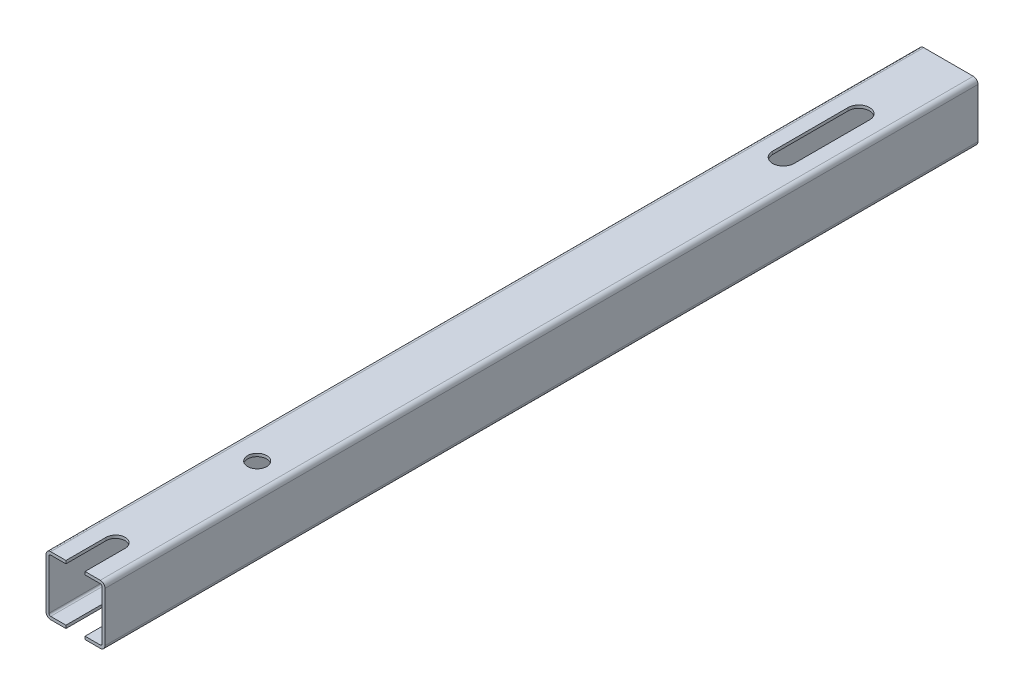
ISO-10303-21;
HEADER;
FILE_DESCRIPTION(('STEP AP214'),'2;1');
FILE_NAME('part.step','',(''),(''),'','','');
FILE_SCHEMA(('AUTOMOTIVE_DESIGN { 1 0 10303 214 1 1 1 1 }'));
ENDSEC;
DATA;
#1=APPLICATION_CONTEXT('core data for automotive mechanical design processes');
#2=APPLICATION_PROTOCOL_DEFINITION('international standard','automotive_design',2000,#1);
#3=PRODUCT_CONTEXT('',#1,'mechanical');
#4=PRODUCT('Part','Part','',(#3));
#5=PRODUCT_RELATED_PRODUCT_CATEGORY('part','',(#4));
#6=PRODUCT_DEFINITION_FORMATION('','',#4);
#7=PRODUCT_DEFINITION_CONTEXT('part definition',#1,'design');
#8=PRODUCT_DEFINITION('design','',#6,#7);
#9=PRODUCT_DEFINITION_SHAPE('','',#8);
#10=(LENGTH_UNIT() NAMED_UNIT(*) SI_UNIT(.MILLI.,.METRE.));
#11=(NAMED_UNIT(*) PLANE_ANGLE_UNIT() SI_UNIT($,.RADIAN.));
#12=(NAMED_UNIT(*) SI_UNIT($,.STERADIAN.) SOLID_ANGLE_UNIT());
#13=UNCERTAINTY_MEASURE_WITH_UNIT(LENGTH_MEASURE(1.E-05),#10,'distance_accuracy_value','');
#14=(GEOMETRIC_REPRESENTATION_CONTEXT(3) GLOBAL_UNCERTAINTY_ASSIGNED_CONTEXT((#13)) GLOBAL_UNIT_ASSIGNED_CONTEXT((#10,
#11,#12)) REPRESENTATION_CONTEXT('',''));
#15=CARTESIAN_POINT('',(0.,0.,0.));
#16=DIRECTION('',(0.,0.,1.));
#17=DIRECTION('',(1.,0.,0.));
#18=AXIS2_PLACEMENT_3D('',#15,#16,#17);
#19=CARTESIAN_POINT('',(23.,2.,370.));
#20=DIRECTION('',(0.,0.,1.));
#21=DIRECTION('',(1.,0.,0.));
#22=AXIS2_PLACEMENT_3D('',#19,#20,#21);
#23=PLANE('',#22);
#24=DIRECTION('',(0.,1.,0.));
#25=VECTOR('',#24,1.);
#26=CARTESIAN_POINT('',(16.55,0.,370.));
#27=LINE('',#26,#25);
#28=CARTESIAN_POINT('',(16.55,0.,370.));
#29=VERTEX_POINT('',#28);
#30=CARTESIAN_POINT('',(16.55,1.25,370.));
#31=VERTEX_POINT('',#30);
#32=EDGE_CURVE('E417',#29,#31,#27,.T.);
#33=ORIENTED_EDGE('',*,*,#32,.F.);
#34=DIRECTION('',(1.,0.,0.));
#35=VECTOR('',#34,1.);
#36=CARTESIAN_POINT('',(2.00000000000001,0.,370.));
#37=LINE('',#36,#35);
#38=CARTESIAN_POINT('',(23.,0.,370.));
#39=VERTEX_POINT('',#38);
#40=EDGE_CURVE('E522',#29,#39,#37,.T.);
#41=ORIENTED_EDGE('',*,*,#40,.T.);
#42=CARTESIAN_POINT('',(23.,2.,370.));
#43=DIRECTION('',(0.,0.,1.));
#44=DIRECTION('',(1.,0.,0.));
#45=AXIS2_PLACEMENT_3D('',#42,#43,#44);
#46=CIRCLE('',#45,2.);
#47=CARTESIAN_POINT('',(25.,2.00000000000001,370.));
#48=VERTEX_POINT('',#47);
#49=EDGE_CURVE('E347',#39,#48,#46,.T.);
#50=ORIENTED_EDGE('',*,*,#49,.T.);
#51=DIRECTION('',(0.,1.,0.));
#52=VECTOR('',#51,1.);
#53=CARTESIAN_POINT('',(25.,2.00000000000001,370.));
#54=LINE('',#53,#52);
#55=CARTESIAN_POINT('',(25.,23.,370.));
#56=VERTEX_POINT('',#55);
#57=EDGE_CURVE('E353',#48,#56,#54,.T.);
#58=ORIENTED_EDGE('',*,*,#57,.T.);
#59=CARTESIAN_POINT('',(23.,23.,370.));
#60=DIRECTION('',(0.,0.,1.));
#61=DIRECTION('',(-1.,0.,0.));
#62=AXIS2_PLACEMENT_3D('',#59,#60,#61);
#63=CIRCLE('',#62,2.);
#64=CARTESIAN_POINT('',(23.,25.,370.));
#65=VERTEX_POINT('',#64);
#66=EDGE_CURVE('E506',#56,#65,#63,.T.);
#67=ORIENTED_EDGE('',*,*,#66,.T.);
#68=DIRECTION('',(-1.,0.,0.));
#69=VECTOR('',#68,1.);
#70=CARTESIAN_POINT('',(2.00000000000001,25.,370.));
#71=LINE('',#70,#69);
#72=CARTESIAN_POINT('',(16.55,25.,370.));
#73=VERTEX_POINT('',#72);
#74=EDGE_CURVE('E510',#65,#73,#71,.T.);
#75=ORIENTED_EDGE('',*,*,#74,.T.);
#76=CARTESIAN_POINT('',(16.55,23.75,370.));
#77=VERTEX_POINT('',#76);
#78=EDGE_CURVE('E650',#77,#73,#27,.T.);
#79=ORIENTED_EDGE('',*,*,#78,.F.);
#80=DIRECTION('',(-1.,0.,0.));
#81=VECTOR('',#80,1.);
#82=CARTESIAN_POINT('',(2.00000000000001,23.75,370.));
#83=LINE('',#82,#81);
#84=CARTESIAN_POINT('',(23.,23.75,370.));
#85=VERTEX_POINT('',#84);
#86=EDGE_CURVE('E423',#85,#77,#83,.T.);
#87=ORIENTED_EDGE('',*,*,#86,.F.);
#88=CARTESIAN_POINT('',(23.,23.,370.));
#89=DIRECTION('',(0.,0.,1.));
#90=DIRECTION('',(-1.,0.,0.));
#91=AXIS2_PLACEMENT_3D('',#88,#89,#90);
#92=CIRCLE('',#91,0.750000000000001);
#93=CARTESIAN_POINT('',(23.75,23.,370.));
#94=VERTEX_POINT('',#93);
#95=EDGE_CURVE('E439',#94,#85,#92,.T.);
#96=ORIENTED_EDGE('',*,*,#95,.F.);
#97=DIRECTION('',(0.,1.,0.));
#98=VECTOR('',#97,1.);
#99=CARTESIAN_POINT('',(23.75,2.,370.));
#100=LINE('',#99,#98);
#101=CARTESIAN_POINT('',(23.75,2.,370.));
#102=VERTEX_POINT('',#101);
#103=EDGE_CURVE('E682',#102,#94,#100,.T.);
#104=ORIENTED_EDGE('',*,*,#103,.F.);
#105=CARTESIAN_POINT('',(23.,2.,370.));
#106=DIRECTION('',(0.,0.,1.));
#107=DIRECTION('',(1.,0.,0.));
#108=AXIS2_PLACEMENT_3D('',#105,#106,#107);
#109=CIRCLE('',#108,0.75);
#110=CARTESIAN_POINT('',(23.,1.25,370.));
#111=VERTEX_POINT('',#110);
#112=EDGE_CURVE('E645',#111,#102,#109,.T.);
#113=ORIENTED_EDGE('',*,*,#112,.F.);
#114=DIRECTION('',(1.,0.,0.));
#115=VECTOR('',#114,1.);
#116=CARTESIAN_POINT('',(2.00000000000001,1.25,370.));
#117=LINE('',#116,#115);
#118=EDGE_CURVE('E640',#31,#111,#117,.T.);
#119=ORIENTED_EDGE('',*,*,#118,.F.);
#120=EDGE_LOOP('',(#33,#41,#50,#58,#67,#75,#79,#87,#96,#104,#113,#119));
#121=FACE_BOUND('',#120,.T.);
#122=ADVANCED_FACE('F40',(#121),#23,.T.);
#123=DIRECTION('',(0.,1.,0.));
#124=VECTOR('',#123,1.);
#125=CARTESIAN_POINT('',(8.44999999999999,0.,370.));
#126=LINE('',#125,#124);
#127=CARTESIAN_POINT('',(8.44999999999999,23.75,370.));
#128=VERTEX_POINT('',#127);
#129=CARTESIAN_POINT('',(8.44999999999999,25.,370.));
#130=VERTEX_POINT('',#129);
#131=EDGE_CURVE('E565',#128,#130,#126,.T.);
#132=ORIENTED_EDGE('',*,*,#131,.T.);
#133=CARTESIAN_POINT('',(2.00000000000001,25.,370.));
#134=VERTEX_POINT('',#133);
#135=EDGE_CURVE('E509',#130,#134,#71,.T.);
#136=ORIENTED_EDGE('',*,*,#135,.T.);
#137=CARTESIAN_POINT('',(1.99999999999999,23.,370.));
#138=DIRECTION('',(0.,0.,1.));
#139=DIRECTION('',(-1.,0.,0.));
#140=AXIS2_PLACEMENT_3D('',#137,#138,#139);
#141=CIRCLE('',#140,2.);
#142=CARTESIAN_POINT('',(0.,23.,370.));
#143=VERTEX_POINT('',#142);
#144=EDGE_CURVE('E513',#134,#143,#141,.T.);
#145=ORIENTED_EDGE('',*,*,#144,.T.);
#146=DIRECTION('',(0.,-1.,0.));
#147=VECTOR('',#146,1.);
#148=CARTESIAN_POINT('',(0.,2.00000000000001,370.));
#149=LINE('',#148,#147);
#150=CARTESIAN_POINT('',(0.,2.,370.));
#151=VERTEX_POINT('',#150);
#152=EDGE_CURVE('E516',#143,#151,#149,.T.);
#153=ORIENTED_EDGE('',*,*,#152,.T.);
#154=CARTESIAN_POINT('',(2.,2.,370.));
#155=DIRECTION('',(0.,0.,1.));
#156=DIRECTION('',(-1.,0.,0.));
#157=AXIS2_PLACEMENT_3D('',#154,#155,#156);
#158=CIRCLE('',#157,2.);
#159=CARTESIAN_POINT('',(2.00000000000001,0.,370.));
#160=VERTEX_POINT('',#159);
#161=EDGE_CURVE('E519',#151,#160,#158,.T.);
#162=ORIENTED_EDGE('',*,*,#161,.T.);
#163=CARTESIAN_POINT('',(8.44999999999999,0.,370.));
#164=VERTEX_POINT('',#163);
#165=EDGE_CURVE('E364',#160,#164,#37,.T.);
#166=ORIENTED_EDGE('',*,*,#165,.T.);
#167=CARTESIAN_POINT('',(8.44999999999999,1.25,370.));
#168=VERTEX_POINT('',#167);
#169=EDGE_CURVE('E647',#164,#168,#126,.T.);
#170=ORIENTED_EDGE('',*,*,#169,.T.);
#171=CARTESIAN_POINT('',(2.00000000000001,1.25,370.));
#172=VERTEX_POINT('',#171);
#173=EDGE_CURVE('E642',#172,#168,#117,.T.);
#174=ORIENTED_EDGE('',*,*,#173,.F.);
#175=CARTESIAN_POINT('',(2.,2.,370.));
#176=DIRECTION('',(0.,0.,1.));
#177=DIRECTION('',(-1.,0.,0.));
#178=AXIS2_PLACEMENT_3D('',#175,#176,#177);
#179=CIRCLE('',#178,0.75);
#180=CARTESIAN_POINT('',(1.25,2.00000000000001,370.));
#181=VERTEX_POINT('',#180);
#182=EDGE_CURVE('E477',#181,#172,#179,.T.);
#183=ORIENTED_EDGE('',*,*,#182,.F.);
#184=DIRECTION('',(0.,-1.,0.));
#185=VECTOR('',#184,1.);
#186=CARTESIAN_POINT('',(1.25,2.00000000000001,370.));
#187=LINE('',#186,#185);
#188=CARTESIAN_POINT('',(1.24999999999999,23.,370.));
#189=VERTEX_POINT('',#188);
#190=EDGE_CURVE('E436',#189,#181,#187,.T.);
#191=ORIENTED_EDGE('',*,*,#190,.F.);
#192=CARTESIAN_POINT('',(1.99999999999999,23.,370.));
#193=DIRECTION('',(0.,0.,1.));
#194=DIRECTION('',(-1.,0.,0.));
#195=AXIS2_PLACEMENT_3D('',#192,#193,#194);
#196=CIRCLE('',#195,0.750000000000001);
#197=CARTESIAN_POINT('',(2.00000000000001,23.75,370.));
#198=VERTEX_POINT('',#197);
#199=EDGE_CURVE('E429',#198,#189,#196,.T.);
#200=ORIENTED_EDGE('',*,*,#199,.F.);
#201=EDGE_CURVE('E430',#128,#198,#83,.T.);
#202=ORIENTED_EDGE('',*,*,#201,.F.);
#203=EDGE_LOOP('',(#132,#136,#145,#153,#162,#166,#170,#174,#183,#191,#200,#202));
#204=FACE_BOUND('',#203,.T.);
#205=ADVANCED_FACE('F562',(#204),#23,.T.);
#206=CARTESIAN_POINT('',(23.,2.,0.));
#207=DIRECTION('',(0.,0.,1.));
#208=DIRECTION('',(1.,0.,0.));
#209=AXIS2_PLACEMENT_3D('',#206,#207,#208);
#210=PLANE('',#209);
#211=DIRECTION('',(1.,0.,0.));
#212=VECTOR('',#211,1.);
#213=CARTESIAN_POINT('',(2.00000000000001,1.25,0.));
#214=LINE('',#213,#212);
#215=CARTESIAN_POINT('',(2.00000000000001,1.25,0.));
#216=VERTEX_POINT('',#215);
#217=CARTESIAN_POINT('',(7.95,1.25,0.));
#218=VERTEX_POINT('',#217);
#219=EDGE_CURVE('E336',#216,#218,#214,.T.);
#220=ORIENTED_EDGE('',*,*,#219,.T.);
#221=DIRECTION('',(0.,-1.,0.));
#222=VECTOR('',#221,1.);
#223=CARTESIAN_POINT('',(7.95,25.001,0.));
#224=LINE('',#223,#222);
#225=CARTESIAN_POINT('',(7.95,0.,0.));
#226=VERTEX_POINT('',#225);
#227=EDGE_CURVE('E317',#218,#226,#224,.T.);
#228=ORIENTED_EDGE('',*,*,#227,.T.);
#229=DIRECTION('',(1.,0.,0.));
#230=VECTOR('',#229,1.);
#231=CARTESIAN_POINT('',(2.00000000000001,0.,0.));
#232=LINE('',#231,#230);
#233=CARTESIAN_POINT('',(2.00000000000001,0.,0.));
#234=VERTEX_POINT('',#233);
#235=EDGE_CURVE('E334',#234,#226,#232,.T.);
#236=ORIENTED_EDGE('',*,*,#235,.F.);
#237=CARTESIAN_POINT('',(2.,2.,0.));
#238=DIRECTION('',(0.,0.,1.));
#239=DIRECTION('',(-1.,0.,0.));
#240=AXIS2_PLACEMENT_3D('',#237,#238,#239);
#241=CIRCLE('',#240,2.);
#242=CARTESIAN_POINT('',(0.,2.,0.));
#243=VERTEX_POINT('',#242);
#244=EDGE_CURVE('E356',#243,#234,#241,.T.);
#245=ORIENTED_EDGE('',*,*,#244,.F.);
#246=DIRECTION('',(0.,-1.,0.));
#247=VECTOR('',#246,1.);
#248=CARTESIAN_POINT('',(0.,2.00000000000001,0.));
#249=LINE('',#248,#247);
#250=CARTESIAN_POINT('',(0.,23.,0.));
#251=VERTEX_POINT('',#250);
#252=EDGE_CURVE('E540',#251,#243,#249,.T.);
#253=ORIENTED_EDGE('',*,*,#252,.F.);
#254=CARTESIAN_POINT('',(1.99999999999999,23.,0.));
#255=DIRECTION('',(0.,0.,1.));
#256=DIRECTION('',(-1.,0.,0.));
#257=AXIS2_PLACEMENT_3D('',#254,#255,#256);
#258=CIRCLE('',#257,2.);
#259=CARTESIAN_POINT('',(2.00000000000001,25.,0.));
#260=VERTEX_POINT('',#259);
#261=EDGE_CURVE('E538',#260,#251,#258,.T.);
#262=ORIENTED_EDGE('',*,*,#261,.F.);
#263=DIRECTION('',(-1.,0.,0.));
#264=VECTOR('',#263,1.);
#265=CARTESIAN_POINT('',(2.00000000000001,25.,0.));
#266=LINE('',#265,#264);
#267=CARTESIAN_POINT('',(23.,25.,0.));
#268=VERTEX_POINT('',#267);
#269=EDGE_CURVE('E535',#268,#260,#266,.T.);
#270=ORIENTED_EDGE('',*,*,#269,.F.);
#271=CARTESIAN_POINT('',(23.,23.,0.));
#272=DIRECTION('',(0.,0.,1.));
#273=DIRECTION('',(-1.,0.,0.));
#274=AXIS2_PLACEMENT_3D('',#271,#272,#273);
#275=CIRCLE('',#274,2.);
#276=CARTESIAN_POINT('',(25.,23.,0.));
#277=VERTEX_POINT('',#276);
#278=EDGE_CURVE('E532',#277,#268,#275,.T.);
#279=ORIENTED_EDGE('',*,*,#278,.F.);
#280=DIRECTION('',(0.,1.,0.));
#281=VECTOR('',#280,1.);
#282=CARTESIAN_POINT('',(25.,2.00000000000001,0.));
#283=LINE('',#282,#281);
#284=CARTESIAN_POINT('',(25.,2.00000000000001,0.));
#285=VERTEX_POINT('',#284);
#286=EDGE_CURVE('E529',#285,#277,#283,.T.);
#287=ORIENTED_EDGE('',*,*,#286,.F.);
#288=CARTESIAN_POINT('',(23.,2.,0.));
#289=DIRECTION('',(0.,0.,1.));
#290=DIRECTION('',(1.,0.,0.));
#291=AXIS2_PLACEMENT_3D('',#288,#289,#290);
#292=CIRCLE('',#291,2.);
#293=CARTESIAN_POINT('',(23.,0.,0.));
#294=VERTEX_POINT('',#293);
#295=EDGE_CURVE('E502',#294,#285,#292,.T.);
#296=ORIENTED_EDGE('',*,*,#295,.F.);
#297=CARTESIAN_POINT('',(17.05,0.,0.));
#298=VERTEX_POINT('',#297);
#299=EDGE_CURVE('E348',#298,#294,#232,.T.);
#300=ORIENTED_EDGE('',*,*,#299,.F.);
#301=DIRECTION('',(0.,-1.,0.));
#302=VECTOR('',#301,1.);
#303=CARTESIAN_POINT('',(17.05,25.001,0.));
#304=LINE('',#303,#302);
#305=CARTESIAN_POINT('',(17.05,1.25,0.));
#306=VERTEX_POINT('',#305);
#307=EDGE_CURVE('E588',#306,#298,#304,.T.);
#308=ORIENTED_EDGE('',*,*,#307,.F.);
#309=CARTESIAN_POINT('',(23.,1.25,0.));
#310=VERTEX_POINT('',#309);
#311=EDGE_CURVE('E449',#306,#310,#214,.T.);
#312=ORIENTED_EDGE('',*,*,#311,.T.);
#313=CARTESIAN_POINT('',(23.,2.,0.));
#314=DIRECTION('',(0.,0.,1.));
#315=DIRECTION('',(1.,0.,0.));
#316=AXIS2_PLACEMENT_3D('',#313,#314,#315);
#317=CIRCLE('',#316,0.75);
#318=CARTESIAN_POINT('',(23.75,2.,0.));
#319=VERTEX_POINT('',#318);
#320=EDGE_CURVE('E453',#310,#319,#317,.T.);
#321=ORIENTED_EDGE('',*,*,#320,.T.);
#322=DIRECTION('',(0.,1.,0.));
#323=VECTOR('',#322,1.);
#324=CARTESIAN_POINT('',(23.75,2.,0.));
#325=LINE('',#324,#323);
#326=CARTESIAN_POINT('',(23.75,23.,0.));
#327=VERTEX_POINT('',#326);
#328=EDGE_CURVE('E457',#319,#327,#325,.T.);
#329=ORIENTED_EDGE('',*,*,#328,.T.);
#330=CARTESIAN_POINT('',(23.,23.,0.));
#331=DIRECTION('',(0.,0.,1.));
#332=DIRECTION('',(-1.,0.,0.));
#333=AXIS2_PLACEMENT_3D('',#330,#331,#332);
#334=CIRCLE('',#333,0.750000000000001);
#335=CARTESIAN_POINT('',(23.,23.75,0.));
#336=VERTEX_POINT('',#335);
#337=EDGE_CURVE('E461',#327,#336,#334,.T.);
#338=ORIENTED_EDGE('',*,*,#337,.T.);
#339=DIRECTION('',(-1.,0.,0.));
#340=VECTOR('',#339,1.);
#341=CARTESIAN_POINT('',(2.00000000000001,23.75,0.));
#342=LINE('',#341,#340);
#343=CARTESIAN_POINT('',(2.00000000000001,23.75,0.));
#344=VERTEX_POINT('',#343);
#345=EDGE_CURVE('E465',#336,#344,#342,.T.);
#346=ORIENTED_EDGE('',*,*,#345,.T.);
#347=CARTESIAN_POINT('',(1.99999999999999,23.,0.));
#348=DIRECTION('',(0.,0.,1.));
#349=DIRECTION('',(-1.,0.,0.));
#350=AXIS2_PLACEMENT_3D('',#347,#348,#349);
#351=CIRCLE('',#350,0.750000000000001);
#352=CARTESIAN_POINT('',(1.24999999999999,23.,0.));
#353=VERTEX_POINT('',#352);
#354=EDGE_CURVE('E469',#344,#353,#351,.T.);
#355=ORIENTED_EDGE('',*,*,#354,.T.);
#356=DIRECTION('',(0.,-1.,0.));
#357=VECTOR('',#356,1.);
#358=CARTESIAN_POINT('',(1.25,2.00000000000001,0.));
#359=LINE('',#358,#357);
#360=CARTESIAN_POINT('',(1.25,2.00000000000001,0.));
#361=VERTEX_POINT('',#360);
#362=EDGE_CURVE('E473',#353,#361,#359,.T.);
#363=ORIENTED_EDGE('',*,*,#362,.T.);
#364=CARTESIAN_POINT('',(2.,2.,0.));
#365=DIRECTION('',(0.,0.,1.));
#366=DIRECTION('',(-1.,0.,0.));
#367=AXIS2_PLACEMENT_3D('',#364,#365,#366);
#368=CIRCLE('',#367,0.75);
#369=EDGE_CURVE('E446',#361,#216,#368,.T.);
#370=ORIENTED_EDGE('',*,*,#369,.T.);
#371=EDGE_LOOP('',(#220,#228,#236,#245,#253,#262,#270,#279,#287,#296,#300,#308,#312,#321,#329,
#338,#346,#355,#363,#370));
#372=FACE_BOUND('',#371,.T.);
#373=ADVANCED_FACE('F332',(#372),#210,.F.);
#374=CARTESIAN_POINT('',(23.,2.,370.));
#375=DIRECTION('',(0.,0.,-1.));
#376=DIRECTION('',(-1.,0.,0.));
#377=AXIS2_PLACEMENT_3D('',#374,#375,#376);
#378=CYLINDRICAL_SURFACE('',#377,2.);
#379=ORIENTED_EDGE('',*,*,#295,.T.);
#380=DIRECTION('',(0.,0.,-1.));
#381=VECTOR('',#380,1.);
#382=CARTESIAN_POINT('',(25.,2.00000000000001,370.));
#383=LINE('',#382,#381);
#384=EDGE_CURVE('E387',#48,#285,#383,.T.);
#385=ORIENTED_EDGE('',*,*,#384,.F.);
#386=ORIENTED_EDGE('',*,*,#49,.F.);
#387=DIRECTION('',(0.,0.,-1.));
#388=VECTOR('',#387,1.);
#389=CARTESIAN_POINT('',(23.,0.,370.));
#390=LINE('',#389,#388);
#391=EDGE_CURVE('E360',#39,#294,#390,.T.);
#392=ORIENTED_EDGE('',*,*,#391,.T.);
#393=EDGE_LOOP('',(#379,#385,#386,#392));
#394=FACE_BOUND('',#393,.T.);
#395=ADVANCED_FACE('F42',(#394),#378,.T.);
#396=CARTESIAN_POINT('',(25.,2.00000000000001,370.));
#397=DIRECTION('',(-1.,0.,0.));
#398=DIRECTION('',(0.,-1.,0.));
#399=AXIS2_PLACEMENT_3D('',#396,#397,#398);
#400=PLANE('',#399);
#401=ORIENTED_EDGE('',*,*,#286,.T.);
#402=DIRECTION('',(0.,0.,-1.));
#403=VECTOR('',#402,1.);
#404=CARTESIAN_POINT('',(25.,23.,370.));
#405=LINE('',#404,#403);
#406=EDGE_CURVE('E383',#56,#277,#405,.T.);
#407=ORIENTED_EDGE('',*,*,#406,.F.);
#408=ORIENTED_EDGE('',*,*,#57,.F.);
#409=ORIENTED_EDGE('',*,*,#384,.T.);
#410=EDGE_LOOP('',(#401,#407,#408,#409));
#411=FACE_BOUND('',#410,.T.);
#412=ADVANCED_FACE('F579',(#411),#400,.F.);
#413=CARTESIAN_POINT('',(23.,23.,370.));
#414=DIRECTION('',(0.,0.,-1.));
#415=DIRECTION('',(-1.,0.,0.));
#416=AXIS2_PLACEMENT_3D('',#413,#414,#415);
#417=CYLINDRICAL_SURFACE('',#416,2.);
#418=ORIENTED_EDGE('',*,*,#278,.T.);
#419=DIRECTION('',(0.,0.,-1.));
#420=VECTOR('',#419,1.);
#421=CARTESIAN_POINT('',(23.,25.,370.));
#422=LINE('',#421,#420);
#423=EDGE_CURVE('E379',#65,#268,#422,.T.);
#424=ORIENTED_EDGE('',*,*,#423,.F.);
#425=ORIENTED_EDGE('',*,*,#66,.F.);
#426=ORIENTED_EDGE('',*,*,#406,.T.);
#427=EDGE_LOOP('',(#418,#424,#425,#426));
#428=FACE_BOUND('',#427,.T.);
#429=ADVANCED_FACE('F573',(#428),#417,.T.);
#430=CARTESIAN_POINT('',(2.00000000000001,25.,370.));
#431=DIRECTION('',(0.,-1.,0.));
#432=DIRECTION('',(0.,0.,-1.));
#433=AXIS2_PLACEMENT_3D('',#430,#431,#432);
#434=PLANE('',#433);
#435=CARTESIAN_POINT('',(12.5,25.,70.));
#436=DIRECTION('',(0.,1.,0.));
#437=DIRECTION('',(0.,0.,1.));
#438=AXIS2_PLACEMENT_3D('',#435,#436,#437);
#439=CIRCLE('',#438,4.55000000000001);
#440=CARTESIAN_POINT('',(7.94999999999999,25.,70.));
#441=VERTEX_POINT('',#440);
#442=CARTESIAN_POINT('',(17.05,25.,70.));
#443=VERTEX_POINT('',#442);
#444=EDGE_CURVE('E619',#441,#443,#439,.T.);
#445=ORIENTED_EDGE('',*,*,#444,.F.);
#446=DIRECTION('',(0.,0.,1.));
#447=VECTOR('',#446,1.);
#448=CARTESIAN_POINT('',(7.95,25.,38.));
#449=LINE('',#448,#447);
#450=CARTESIAN_POINT('',(7.95,25.,38.));
#451=VERTEX_POINT('',#450);
#452=EDGE_CURVE('E616',#451,#441,#449,.T.);
#453=ORIENTED_EDGE('',*,*,#452,.F.);
#454=CARTESIAN_POINT('',(12.5,25.,38.));
#455=DIRECTION('',(0.,1.,0.));
#456=DIRECTION('',(0.,0.,1.));
#457=AXIS2_PLACEMENT_3D('',#454,#455,#456);
#458=CIRCLE('',#457,4.55);
#459=CARTESIAN_POINT('',(17.05,25.,38.));
#460=VERTEX_POINT('',#459);
#461=EDGE_CURVE('E620',#460,#451,#458,.T.);
#462=ORIENTED_EDGE('',*,*,#461,.F.);
#463=DIRECTION('',(0.,0.,-1.));
#464=VECTOR('',#463,1.);
#465=CARTESIAN_POINT('',(17.05,25.,38.));
#466=LINE('',#465,#464);
#467=EDGE_CURVE('E71',#443,#460,#466,.T.);
#468=ORIENTED_EDGE('',*,*,#467,.F.);
#469=EDGE_LOOP('',(#445,#453,#462,#468));
#470=FACE_BOUND('',#469,.T.);
#471=CARTESIAN_POINT('',(12.5,25.,293.));
#472=DIRECTION('',(0.,1.,0.));
#473=DIRECTION('',(0.,0.,1.));
#474=AXIS2_PLACEMENT_3D('',#471,#472,#473);
#475=CIRCLE('',#474,4.05000000000003);
#476=CARTESIAN_POINT('',(12.5,25.,297.05));
#477=VERTEX_POINT('',#476);
#478=EDGE_CURVE('E679',#477,#477,#475,.T.);
#479=ORIENTED_EDGE('',*,*,#478,.F.);
#480=EDGE_LOOP('',(#479));
#481=FACE_BOUND('',#480,.T.);
#482=CARTESIAN_POINT('',(12.5,25.,353.));
#483=DIRECTION('',(0.,1.,0.));
#484=DIRECTION('',(0.,0.,-1.));
#485=AXIS2_PLACEMENT_3D('',#482,#483,#484);
#486=CIRCLE('',#485,4.05);
#487=CARTESIAN_POINT('',(16.55,25.,353.));
#488=VERTEX_POINT('',#487);
#489=CARTESIAN_POINT('',(8.45,25.,353.));
#490=VERTEX_POINT('',#489);
#491=EDGE_CURVE('E961',#488,#490,#486,.T.);
#492=ORIENTED_EDGE('',*,*,#491,.F.);
#493=DIRECTION('',(0.,0.,-1.));
#494=VECTOR('',#493,1.);
#495=CARTESIAN_POINT('',(16.55,25.,353.));
#496=LINE('',#495,#494);
#497=EDGE_CURVE('E413',#73,#488,#496,.T.);
#498=ORIENTED_EDGE('',*,*,#497,.F.);
#499=ORIENTED_EDGE('',*,*,#74,.F.);
#500=ORIENTED_EDGE('',*,*,#423,.T.);
#501=ORIENTED_EDGE('',*,*,#269,.T.);
#502=DIRECTION('',(0.,0.,-1.));
#503=VECTOR('',#502,1.);
#504=CARTESIAN_POINT('',(2.00000000000001,25.,370.));
#505=LINE('',#504,#503);
#506=EDGE_CURVE('E375',#134,#260,#505,.T.);
#507=ORIENTED_EDGE('',*,*,#506,.F.);
#508=ORIENTED_EDGE('',*,*,#135,.F.);
#509=DIRECTION('',(0.,0.,1.));
#510=VECTOR('',#509,1.);
#511=CARTESIAN_POINT('',(8.45,25.,353.));
#512=LINE('',#511,#510);
#513=EDGE_CURVE('E958',#490,#130,#512,.T.);
#514=ORIENTED_EDGE('',*,*,#513,.F.);
#515=EDGE_LOOP('',(#492,#498,#499,#500,#501,#507,#508,#514));
#516=FACE_BOUND('',#515,.T.);
#517=ADVANCED_FACE('F568',(#470,#481,#516),#434,.F.);
#518=CARTESIAN_POINT('',(1.99999999999999,23.,370.));
#519=DIRECTION('',(0.,0.,-1.));
#520=DIRECTION('',(-1.,0.,0.));
#521=AXIS2_PLACEMENT_3D('',#518,#519,#520);
#522=CYLINDRICAL_SURFACE('',#521,2.);
#523=ORIENTED_EDGE('',*,*,#261,.T.);
#524=DIRECTION('',(0.,0.,-1.));
#525=VECTOR('',#524,1.);
#526=CARTESIAN_POINT('',(0.,23.,370.));
#527=LINE('',#526,#525);
#528=EDGE_CURVE('E371',#143,#251,#527,.T.);
#529=ORIENTED_EDGE('',*,*,#528,.F.);
#530=ORIENTED_EDGE('',*,*,#144,.F.);
#531=ORIENTED_EDGE('',*,*,#506,.T.);
#532=EDGE_LOOP('',(#523,#529,#530,#531));
#533=FACE_BOUND('',#532,.T.);
#534=ADVANCED_FACE('F555',(#533),#522,.T.);
#535=CARTESIAN_POINT('',(0.,2.00000000000001,370.));
#536=DIRECTION('',(1.,0.,0.));
#537=DIRECTION('',(0.,1.,0.));
#538=AXIS2_PLACEMENT_3D('',#535,#536,#537);
#539=PLANE('',#538);
#540=ORIENTED_EDGE('',*,*,#252,.T.);
#541=DIRECTION('',(0.,0.,-1.));
#542=VECTOR('',#541,1.);
#543=CARTESIAN_POINT('',(0.,2.,370.));
#544=LINE('',#543,#542);
#545=EDGE_CURVE('E367',#151,#243,#544,.T.);
#546=ORIENTED_EDGE('',*,*,#545,.F.);
#547=ORIENTED_EDGE('',*,*,#152,.F.);
#548=ORIENTED_EDGE('',*,*,#528,.T.);
#549=EDGE_LOOP('',(#540,#546,#547,#548));
#550=FACE_BOUND('',#549,.T.);
#551=ADVANCED_FACE('F559',(#550),#539,.F.);
#552=CARTESIAN_POINT('',(2.,2.,370.));
#553=DIRECTION('',(0.,0.,-1.));
#554=DIRECTION('',(-1.,0.,0.));
#555=AXIS2_PLACEMENT_3D('',#552,#553,#554);
#556=CYLINDRICAL_SURFACE('',#555,2.);
#557=ORIENTED_EDGE('',*,*,#244,.T.);
#558=DIRECTION('',(0.,0.,-1.));
#559=VECTOR('',#558,1.);
#560=CARTESIAN_POINT('',(2.00000000000001,0.,370.));
#561=LINE('',#560,#559);
#562=EDGE_CURVE('E345',#160,#234,#561,.T.);
#563=ORIENTED_EDGE('',*,*,#562,.F.);
#564=ORIENTED_EDGE('',*,*,#161,.F.);
#565=ORIENTED_EDGE('',*,*,#545,.T.);
#566=EDGE_LOOP('',(#557,#563,#564,#565));
#567=FACE_BOUND('',#566,.T.);
#568=ADVANCED_FACE('F548',(#567),#556,.T.);
#569=CARTESIAN_POINT('',(2.00000000000001,0.,370.));
#570=DIRECTION('',(0.,1.,0.));
#571=DIRECTION('',(0.,0.,1.));
#572=AXIS2_PLACEMENT_3D('',#569,#570,#571);
#573=PLANE('',#572);
#574=CARTESIAN_POINT('',(12.5,0.,53.));
#575=DIRECTION('',(0.,-1.,0.));
#576=DIRECTION('',(0.,0.,-1.));
#577=AXIS2_PLACEMENT_3D('',#574,#575,#576);
#578=CIRCLE('',#577,6.);
#579=CARTESIAN_POINT('',(12.5,0.,47.));
#580=VERTEX_POINT('',#579);
#581=EDGE_CURVE('E590',#580,#580,#578,.T.);
#582=ORIENTED_EDGE('',*,*,#581,.F.);
#583=EDGE_LOOP('',(#582));
#584=FACE_BOUND('',#583,.T.);
#585=CARTESIAN_POINT('',(12.5,0.,293.));
#586=DIRECTION('',(0.,1.,0.));
#587=DIRECTION('',(0.,0.,1.));
#588=AXIS2_PLACEMENT_3D('',#585,#586,#587);
#589=CIRCLE('',#588,4.05000000000003);
#590=CARTESIAN_POINT('',(12.5,0.,297.05));
#591=VERTEX_POINT('',#590);
#592=EDGE_CURVE('E663',#591,#591,#589,.T.);
#593=ORIENTED_EDGE('',*,*,#592,.T.);
#594=EDGE_LOOP('',(#593));
#595=FACE_BOUND('',#594,.T.);
#596=ORIENTED_EDGE('',*,*,#235,.T.);
#597=DIRECTION('',(0.,0.,-1.));
#598=VECTOR('',#597,1.);
#599=CARTESIAN_POINT('',(7.95,0.,0.));
#600=LINE('',#599,#598);
#601=CARTESIAN_POINT('',(7.94999999999999,0.,17.));
#602=VERTEX_POINT('',#601);
#603=EDGE_CURVE('E314',#602,#226,#600,.T.);
#604=ORIENTED_EDGE('',*,*,#603,.F.);
#605=CARTESIAN_POINT('',(12.5,0.,17.));
#606=DIRECTION('',(0.,-1.,0.));
#607=DIRECTION('',(0.,0.,1.));
#608=AXIS2_PLACEMENT_3D('',#605,#606,#607);
#609=CIRCLE('',#608,4.55);
#610=CARTESIAN_POINT('',(17.05,0.,17.));
#611=VERTEX_POINT('',#610);
#612=EDGE_CURVE('E327',#611,#602,#609,.T.);
#613=ORIENTED_EDGE('',*,*,#612,.F.);
#614=DIRECTION('',(0.,0.,1.));
#615=VECTOR('',#614,1.);
#616=CARTESIAN_POINT('',(17.05,0.,17.));
#617=LINE('',#616,#615);
#618=EDGE_CURVE('E586',#298,#611,#617,.T.);
#619=ORIENTED_EDGE('',*,*,#618,.F.);
#620=ORIENTED_EDGE('',*,*,#299,.T.);
#621=ORIENTED_EDGE('',*,*,#391,.F.);
#622=ORIENTED_EDGE('',*,*,#40,.F.);
#623=DIRECTION('',(0.,0.,-1.));
#624=VECTOR('',#623,1.);
#625=CARTESIAN_POINT('',(16.55,0.,353.));
#626=LINE('',#625,#624);
#627=CARTESIAN_POINT('',(16.55,0.,353.));
#628=VERTEX_POINT('',#627);
#629=EDGE_CURVE('E657',#29,#628,#626,.T.);
#630=ORIENTED_EDGE('',*,*,#629,.T.);
#631=CARTESIAN_POINT('',(12.5,0.,353.));
#632=DIRECTION('',(0.,1.,0.));
#633=DIRECTION('',(0.,0.,-1.));
#634=AXIS2_PLACEMENT_3D('',#631,#632,#633);
#635=CIRCLE('',#634,4.05);
#636=CARTESIAN_POINT('',(8.45,0.,353.));
#637=VERTEX_POINT('',#636);
#638=EDGE_CURVE('E658',#628,#637,#635,.T.);
#639=ORIENTED_EDGE('',*,*,#638,.T.);
#640=DIRECTION('',(0.,0.,1.));
#641=VECTOR('',#640,1.);
#642=CARTESIAN_POINT('',(8.45,0.,353.));
#643=LINE('',#642,#641);
#644=EDGE_CURVE('E654',#637,#164,#643,.T.);
#645=ORIENTED_EDGE('',*,*,#644,.T.);
#646=ORIENTED_EDGE('',*,*,#165,.F.);
#647=ORIENTED_EDGE('',*,*,#562,.T.);
#648=EDGE_LOOP('',(#596,#604,#613,#619,#620,#621,#622,#630,#639,#645,#646,#647));
#649=FACE_BOUND('',#648,.T.);
#650=ADVANCED_FACE('F342',(#584,#595,#649),#573,.F.);
#651=CARTESIAN_POINT('',(2.,2.,370.));
#652=DIRECTION('',(0.,0.,-1.));
#653=DIRECTION('',(-1.,0.,0.));
#654=AXIS2_PLACEMENT_3D('',#651,#652,#653);
#655=CYLINDRICAL_SURFACE('',#654,0.75);
#656=ORIENTED_EDGE('',*,*,#369,.F.);
#657=DIRECTION('',(0.,0.,-1.));
#658=VECTOR('',#657,1.);
#659=CARTESIAN_POINT('',(1.25,2.00000000000001,370.));
#660=LINE('',#659,#658);
#661=EDGE_CURVE('E445',#181,#361,#660,.T.);
#662=ORIENTED_EDGE('',*,*,#661,.F.);
#663=ORIENTED_EDGE('',*,*,#182,.T.);
#664=DIRECTION('',(0.,0.,-1.));
#665=VECTOR('',#664,1.);
#666=CARTESIAN_POINT('',(2.00000000000001,1.25,370.));
#667=LINE('',#666,#665);
#668=EDGE_CURVE('E499',#172,#216,#667,.T.);
#669=ORIENTED_EDGE('',*,*,#668,.T.);
#670=EDGE_LOOP('',(#656,#662,#663,#669));
#671=FACE_BOUND('',#670,.T.);
#672=ADVANCED_FACE('F710',(#671),#655,.F.);
#673=CARTESIAN_POINT('',(2.00000000000001,1.25,370.));
#674=DIRECTION('',(0.,1.,0.));
#675=DIRECTION('',(0.,0.,1.));
#676=AXIS2_PLACEMENT_3D('',#673,#674,#675);
#677=PLANE('',#676);
#678=DIRECTION('',(0.,0.,-1.));
#679=VECTOR('',#678,1.);
#680=CARTESIAN_POINT('',(7.95,1.25,0.));
#681=LINE('',#680,#679);
#682=CARTESIAN_POINT('',(7.95,1.25,17.));
#683=VERTEX_POINT('',#682);
#684=EDGE_CURVE('E339',#683,#218,#681,.T.);
#685=ORIENTED_EDGE('',*,*,#684,.T.);
#686=ORIENTED_EDGE('',*,*,#219,.F.);
#687=ORIENTED_EDGE('',*,*,#668,.F.);
#688=ORIENTED_EDGE('',*,*,#173,.T.);
#689=DIRECTION('',(0.,0.,1.));
#690=VECTOR('',#689,1.);
#691=CARTESIAN_POINT('',(8.44999999999999,1.25,370.));
#692=LINE('',#691,#690);
#693=CARTESIAN_POINT('',(8.45,1.25,353.));
#694=VERTEX_POINT('',#693);
#695=EDGE_CURVE('E660',#694,#168,#692,.T.);
#696=ORIENTED_EDGE('',*,*,#695,.F.);
#697=CARTESIAN_POINT('',(12.5,1.25,353.));
#698=DIRECTION('',(0.,1.,0.));
#699=DIRECTION('',(0.,0.,1.));
#700=AXIS2_PLACEMENT_3D('',#697,#698,#699);
#701=CIRCLE('',#700,4.05);
#702=CARTESIAN_POINT('',(16.55,1.25,353.));
#703=VERTEX_POINT('',#702);
#704=EDGE_CURVE('E671',#703,#694,#701,.T.);
#705=ORIENTED_EDGE('',*,*,#704,.F.);
#706=DIRECTION('',(0.,0.,-1.));
#707=VECTOR('',#706,1.);
#708=CARTESIAN_POINT('',(16.55,1.25,370.));
#709=LINE('',#708,#707);
#710=EDGE_CURVE('E662',#31,#703,#709,.T.);
#711=ORIENTED_EDGE('',*,*,#710,.F.);
#712=ORIENTED_EDGE('',*,*,#118,.T.);
#713=DIRECTION('',(0.,0.,-1.));
#714=VECTOR('',#713,1.);
#715=CARTESIAN_POINT('',(23.,1.25,370.));
#716=LINE('',#715,#714);
#717=EDGE_CURVE('E495',#111,#310,#716,.T.);
#718=ORIENTED_EDGE('',*,*,#717,.T.);
#719=ORIENTED_EDGE('',*,*,#311,.F.);
#720=DIRECTION('',(0.,0.,1.));
#721=VECTOR('',#720,1.);
#722=CARTESIAN_POINT('',(17.05,1.25,17.));
#723=LINE('',#722,#721);
#724=CARTESIAN_POINT('',(17.05,1.25,17.));
#725=VERTEX_POINT('',#724);
#726=EDGE_CURVE('E597',#306,#725,#723,.T.);
#727=ORIENTED_EDGE('',*,*,#726,.T.);
#728=CARTESIAN_POINT('',(12.5,1.25,17.));
#729=DIRECTION('',(0.,1.,0.));
#730=DIRECTION('',(0.,0.,1.));
#731=AXIS2_PLACEMENT_3D('',#728,#729,#730);
#732=CIRCLE('',#731,4.55);
#733=EDGE_CURVE('E338',#725,#683,#732,.F.);
#734=ORIENTED_EDGE('',*,*,#733,.T.);
#735=EDGE_LOOP('',(#685,#686,#687,#688,#696,#705,#711,#712,#718,#719,#727,#734));
#736=FACE_BOUND('',#735,.T.);
#737=CARTESIAN_POINT('',(12.5,1.25,53.));
#738=DIRECTION('',(0.,1.,0.));
#739=DIRECTION('',(0.,0.,1.));
#740=AXIS2_PLACEMENT_3D('',#737,#738,#739);
#741=CIRCLE('',#740,6.);
#742=CARTESIAN_POINT('',(12.5,1.25,59.));
#743=VERTEX_POINT('',#742);
#744=EDGE_CURVE('E632',#743,#743,#741,.F.);
#745=ORIENTED_EDGE('',*,*,#744,.T.);
#746=EDGE_LOOP('',(#745));
#747=FACE_BOUND('',#746,.T.);
#748=CARTESIAN_POINT('',(12.5,1.25,293.));
#749=DIRECTION('',(0.,1.,0.));
#750=DIRECTION('',(0.,0.,1.));
#751=AXIS2_PLACEMENT_3D('',#748,#749,#750);
#752=CIRCLE('',#751,4.05000000000003);
#753=CARTESIAN_POINT('',(12.5,1.25,297.05));
#754=VERTEX_POINT('',#753);
#755=EDGE_CURVE('E450',#754,#754,#752,.T.);
#756=ORIENTED_EDGE('',*,*,#755,.F.);
#757=EDGE_LOOP('',(#756));
#758=FACE_BOUND('',#757,.T.);
#759=ADVANCED_FACE('F594',(#736,#747,#758),#677,.T.);
#760=CARTESIAN_POINT('',(23.,2.,370.));
#761=DIRECTION('',(0.,0.,-1.));
#762=DIRECTION('',(-1.,0.,0.));
#763=AXIS2_PLACEMENT_3D('',#760,#761,#762);
#764=CYLINDRICAL_SURFACE('',#763,0.75);
#765=ORIENTED_EDGE('',*,*,#320,.F.);
#766=ORIENTED_EDGE('',*,*,#717,.F.);
#767=ORIENTED_EDGE('',*,*,#112,.T.);
#768=DIRECTION('',(0.,0.,-1.));
#769=VECTOR('',#768,1.);
#770=CARTESIAN_POINT('',(23.75,2.,370.));
#771=LINE('',#770,#769);
#772=EDGE_CURVE('E492',#102,#319,#771,.T.);
#773=ORIENTED_EDGE('',*,*,#772,.T.);
#774=EDGE_LOOP('',(#765,#766,#767,#773));
#775=FACE_BOUND('',#774,.T.);
#776=ADVANCED_FACE('F933',(#775),#764,.F.);
#777=CARTESIAN_POINT('',(23.75,2.,370.));
#778=DIRECTION('',(-1.,0.,0.));
#779=DIRECTION('',(0.,0.,1.));
#780=AXIS2_PLACEMENT_3D('',#777,#778,#779);
#781=PLANE('',#780);
#782=ORIENTED_EDGE('',*,*,#328,.F.);
#783=ORIENTED_EDGE('',*,*,#772,.F.);
#784=ORIENTED_EDGE('',*,*,#103,.T.);
#785=DIRECTION('',(0.,0.,-1.));
#786=VECTOR('',#785,1.);
#787=CARTESIAN_POINT('',(23.75,23.,370.));
#788=LINE('',#787,#786);
#789=EDGE_CURVE('E489',#94,#327,#788,.T.);
#790=ORIENTED_EDGE('',*,*,#789,.T.);
#791=EDGE_LOOP('',(#782,#783,#784,#790));
#792=FACE_BOUND('',#791,.T.);
#793=ADVANCED_FACE('F696',(#792),#781,.T.);
#794=CARTESIAN_POINT('',(23.,23.,370.));
#795=DIRECTION('',(0.,0.,-1.));
#796=DIRECTION('',(-1.,0.,0.));
#797=AXIS2_PLACEMENT_3D('',#794,#795,#796);
#798=CYLINDRICAL_SURFACE('',#797,0.750000000000001);
#799=ORIENTED_EDGE('',*,*,#337,.F.);
#800=ORIENTED_EDGE('',*,*,#789,.F.);
#801=ORIENTED_EDGE('',*,*,#95,.T.);
#802=DIRECTION('',(0.,0.,-1.));
#803=VECTOR('',#802,1.);
#804=CARTESIAN_POINT('',(23.,23.75,370.));
#805=LINE('',#804,#803);
#806=EDGE_CURVE('E425',#85,#336,#805,.T.);
#807=ORIENTED_EDGE('',*,*,#806,.T.);
#808=EDGE_LOOP('',(#799,#800,#801,#807));
#809=FACE_BOUND('',#808,.T.);
#810=ADVANCED_FACE('F700',(#809),#798,.F.);
#811=CARTESIAN_POINT('',(2.00000000000001,23.75,370.));
#812=DIRECTION('',(0.,-1.,0.));
#813=DIRECTION('',(0.,0.,-1.));
#814=AXIS2_PLACEMENT_3D('',#811,#812,#813);
#815=PLANE('',#814);
#816=DIRECTION('',(0.,0.,1.));
#817=VECTOR('',#816,1.);
#818=CARTESIAN_POINT('',(7.95,23.75,38.));
#819=LINE('',#818,#817);
#820=CARTESIAN_POINT('',(7.95,23.75,38.));
#821=VERTEX_POINT('',#820);
#822=CARTESIAN_POINT('',(7.94999999999999,23.75,70.));
#823=VERTEX_POINT('',#822);
#824=EDGE_CURVE('E965',#821,#823,#819,.T.);
#825=ORIENTED_EDGE('',*,*,#824,.T.);
#826=CARTESIAN_POINT('',(12.5,23.75,70.));
#827=DIRECTION('',(0.,-1.,0.));
#828=DIRECTION('',(0.,0.,-1.));
#829=AXIS2_PLACEMENT_3D('',#826,#827,#828);
#830=CIRCLE('',#829,4.55000000000001);
#831=CARTESIAN_POINT('',(17.05,23.75,70.));
#832=VERTEX_POINT('',#831);
#833=EDGE_CURVE('E326',#823,#832,#830,.F.);
#834=ORIENTED_EDGE('',*,*,#833,.T.);
#835=DIRECTION('',(0.,0.,-1.));
#836=VECTOR('',#835,1.);
#837=CARTESIAN_POINT('',(17.05,23.75,38.));
#838=LINE('',#837,#836);
#839=CARTESIAN_POINT('',(17.05,23.75,38.));
#840=VERTEX_POINT('',#839);
#841=EDGE_CURVE('E627',#832,#840,#838,.T.);
#842=ORIENTED_EDGE('',*,*,#841,.T.);
#843=CARTESIAN_POINT('',(12.5,23.75,38.));
#844=DIRECTION('',(0.,-1.,0.));
#845=DIRECTION('',(0.,0.,-1.));
#846=AXIS2_PLACEMENT_3D('',#843,#844,#845);
#847=CIRCLE('',#846,4.55);
#848=EDGE_CURVE('E630',#840,#821,#847,.F.);
#849=ORIENTED_EDGE('',*,*,#848,.T.);
#850=EDGE_LOOP('',(#825,#834,#842,#849));
#851=FACE_BOUND('',#850,.T.);
#852=CARTESIAN_POINT('',(12.5,23.75,293.));
#853=DIRECTION('',(0.,-1.,0.));
#854=DIRECTION('',(0.,0.,-1.));
#855=AXIS2_PLACEMENT_3D('',#852,#853,#854);
#856=CIRCLE('',#855,4.05000000000003);
#857=CARTESIAN_POINT('',(12.5,23.75,288.95));
#858=VERTEX_POINT('',#857);
#859=EDGE_CURVE('E44',#858,#858,#856,.T.);
#860=ORIENTED_EDGE('',*,*,#859,.F.);
#861=EDGE_LOOP('',(#860));
#862=FACE_BOUND('',#861,.T.);
#863=DIRECTION('',(0.,0.,1.));
#864=VECTOR('',#863,1.);
#865=CARTESIAN_POINT('',(16.55,23.75,370.));
#866=LINE('',#865,#864);
#867=CARTESIAN_POINT('',(16.55,23.75,353.));
#868=VERTEX_POINT('',#867);
#869=EDGE_CURVE('E11',#868,#77,#866,.T.);
#870=ORIENTED_EDGE('',*,*,#869,.F.);
#871=CARTESIAN_POINT('',(12.5,23.75,353.));
#872=DIRECTION('',(0.,-1.,0.));
#873=DIRECTION('',(0.,0.,-1.));
#874=AXIS2_PLACEMENT_3D('',#871,#872,#873);
#875=CIRCLE('',#874,4.05);
#876=CARTESIAN_POINT('',(8.45,23.75,353.));
#877=VERTEX_POINT('',#876);
#878=EDGE_CURVE('E50',#877,#868,#875,.T.);
#879=ORIENTED_EDGE('',*,*,#878,.F.);
#880=DIRECTION('',(0.,0.,-1.));
#881=VECTOR('',#880,1.);
#882=CARTESIAN_POINT('',(8.44999999999999,23.75,370.));
#883=LINE('',#882,#881);
#884=EDGE_CURVE('E391',#128,#877,#883,.T.);
#885=ORIENTED_EDGE('',*,*,#884,.F.);
#886=ORIENTED_EDGE('',*,*,#201,.T.);
#887=DIRECTION('',(0.,0.,-1.));
#888=VECTOR('',#887,1.);
#889=CARTESIAN_POINT('',(2.00000000000001,23.75,370.));
#890=LINE('',#889,#888);
#891=EDGE_CURVE('E484',#198,#344,#890,.T.);
#892=ORIENTED_EDGE('',*,*,#891,.T.);
#893=ORIENTED_EDGE('',*,*,#345,.F.);
#894=ORIENTED_EDGE('',*,*,#806,.F.);
#895=ORIENTED_EDGE('',*,*,#86,.T.);
#896=EDGE_LOOP('',(#870,#879,#885,#886,#892,#893,#894,#895));
#897=FACE_BOUND('',#896,.T.);
#898=ADVANCED_FACE('F420',(#851,#862,#897),#815,.T.);
#899=CARTESIAN_POINT('',(1.99999999999999,23.,370.));
#900=DIRECTION('',(0.,0.,-1.));
#901=DIRECTION('',(-1.,0.,0.));
#902=AXIS2_PLACEMENT_3D('',#899,#900,#901);
#903=CYLINDRICAL_SURFACE('',#902,0.750000000000001);
#904=ORIENTED_EDGE('',*,*,#354,.F.);
#905=ORIENTED_EDGE('',*,*,#891,.F.);
#906=ORIENTED_EDGE('',*,*,#199,.T.);
#907=DIRECTION('',(0.,0.,-1.));
#908=VECTOR('',#907,1.);
#909=CARTESIAN_POINT('',(1.24999999999999,23.,370.));
#910=LINE('',#909,#908);
#911=EDGE_CURVE('E481',#189,#353,#910,.T.);
#912=ORIENTED_EDGE('',*,*,#911,.T.);
#913=EDGE_LOOP('',(#904,#905,#906,#912));
#914=FACE_BOUND('',#913,.T.);
#915=ADVANCED_FACE('F842',(#914),#903,.F.);
#916=CARTESIAN_POINT('',(1.25,2.00000000000001,370.));
#917=DIRECTION('',(1.,0.,0.));
#918=DIRECTION('',(0.,1.,0.));
#919=AXIS2_PLACEMENT_3D('',#916,#917,#918);
#920=PLANE('',#919);
#921=ORIENTED_EDGE('',*,*,#362,.F.);
#922=ORIENTED_EDGE('',*,*,#911,.F.);
#923=ORIENTED_EDGE('',*,*,#190,.T.);
#924=ORIENTED_EDGE('',*,*,#661,.T.);
#925=EDGE_LOOP('',(#921,#922,#923,#924));
#926=FACE_BOUND('',#925,.T.);
#927=ADVANCED_FACE('F757',(#926),#920,.T.);
#928=CARTESIAN_POINT('',(16.55,0.,353.));
#929=DIRECTION('',(1.,0.,0.));
#930=DIRECTION('',(0.,0.,-1.));
#931=AXIS2_PLACEMENT_3D('',#928,#929,#930);
#932=PLANE('',#931);
#933=ORIENTED_EDGE('',*,*,#869,.T.);
#934=ORIENTED_EDGE('',*,*,#78,.T.);
#935=ORIENTED_EDGE('',*,*,#497,.T.);
#936=DIRECTION('',(0.,1.,0.));
#937=VECTOR('',#936,1.);
#938=CARTESIAN_POINT('',(16.55,0.,353.));
#939=LINE('',#938,#937);
#940=EDGE_CURVE('E403',#868,#488,#939,.T.);
#941=ORIENTED_EDGE('',*,*,#940,.F.);
#942=EDGE_LOOP('',(#933,#934,#935,#941));
#943=FACE_BOUND('',#942,.T.);
#944=ADVANCED_FACE('F410',(#943),#932,.F.);
#945=CARTESIAN_POINT('',(8.45,0.,353.));
#946=DIRECTION('',(-1.,0.,0.));
#947=DIRECTION('',(0.,0.,1.));
#948=AXIS2_PLACEMENT_3D('',#945,#946,#947);
#949=PLANE('',#948);
#950=ORIENTED_EDGE('',*,*,#884,.T.);
#951=DIRECTION('',(0.,1.,0.));
#952=VECTOR('',#951,1.);
#953=CARTESIAN_POINT('',(8.45,0.,353.));
#954=LINE('',#953,#952);
#955=EDGE_CURVE('E405',#877,#490,#954,.T.);
#956=ORIENTED_EDGE('',*,*,#955,.T.);
#957=ORIENTED_EDGE('',*,*,#513,.T.);
#958=ORIENTED_EDGE('',*,*,#131,.F.);
#959=EDGE_LOOP('',(#950,#956,#957,#958));
#960=FACE_BOUND('',#959,.T.);
#961=ADVANCED_FACE('F756',(#960),#949,.F.);
#962=CARTESIAN_POINT('',(12.5,0.,353.));
#963=DIRECTION('',(0.,1.,0.));
#964=DIRECTION('',(0.,0.,1.));
#965=AXIS2_PLACEMENT_3D('',#962,#963,#964);
#966=CYLINDRICAL_SURFACE('',#965,4.05);
#967=ORIENTED_EDGE('',*,*,#878,.T.);
#968=ORIENTED_EDGE('',*,*,#940,.T.);
#969=ORIENTED_EDGE('',*,*,#491,.T.);
#970=ORIENTED_EDGE('',*,*,#955,.F.);
#971=EDGE_LOOP('',(#967,#968,#969,#970));
#972=FACE_BOUND('',#971,.T.);
#973=ADVANCED_FACE('F401',(#972),#966,.F.);
#974=CARTESIAN_POINT('',(12.5,0.,293.));
#975=DIRECTION('',(0.,1.,0.));
#976=DIRECTION('',(0.,0.,1.));
#977=AXIS2_PLACEMENT_3D('',#974,#975,#976);
#978=CYLINDRICAL_SURFACE('',#977,4.05000000000003);
#979=ORIENTED_EDGE('',*,*,#859,.T.);
#980=EDGE_LOOP('',(#979));
#981=FACE_BOUND('',#980,.T.);
#982=ORIENTED_EDGE('',*,*,#478,.T.);
#983=EDGE_LOOP('',(#982));
#984=FACE_BOUND('',#983,.T.);
#985=ADVANCED_FACE('F778',(#981,#984),#978,.F.);
#986=ORIENTED_EDGE('',*,*,#704,.T.);
#987=EDGE_CURVE('E665',#637,#694,#954,.T.);
#988=ORIENTED_EDGE('',*,*,#987,.F.);
#989=ORIENTED_EDGE('',*,*,#638,.F.);
#990=EDGE_CURVE('E416',#628,#703,#939,.T.);
#991=ORIENTED_EDGE('',*,*,#990,.T.);
#992=EDGE_LOOP('',(#986,#988,#989,#991));
#993=FACE_BOUND('',#992,.T.);
#994=ADVANCED_FACE('F780',(#993),#966,.F.);
#995=ORIENTED_EDGE('',*,*,#710,.T.);
#996=ORIENTED_EDGE('',*,*,#990,.F.);
#997=ORIENTED_EDGE('',*,*,#629,.F.);
#998=ORIENTED_EDGE('',*,*,#32,.T.);
#999=EDGE_LOOP('',(#995,#996,#997,#998));
#1000=FACE_BOUND('',#999,.T.);
#1001=ADVANCED_FACE('F759',(#1000),#932,.F.);
#1002=ORIENTED_EDGE('',*,*,#695,.T.);
#1003=ORIENTED_EDGE('',*,*,#169,.F.);
#1004=ORIENTED_EDGE('',*,*,#644,.F.);
#1005=ORIENTED_EDGE('',*,*,#987,.T.);
#1006=EDGE_LOOP('',(#1002,#1003,#1004,#1005));
#1007=FACE_BOUND('',#1006,.T.);
#1008=ADVANCED_FACE('F770',(#1007),#949,.F.);
#1009=ORIENTED_EDGE('',*,*,#755,.T.);
#1010=EDGE_LOOP('',(#1009));
#1011=FACE_BOUND('',#1010,.T.);
#1012=ORIENTED_EDGE('',*,*,#592,.F.);
#1013=EDGE_LOOP('',(#1012));
#1014=FACE_BOUND('',#1013,.T.);
#1015=ADVANCED_FACE('F790',(#1011,#1014),#978,.F.);
#1016=CARTESIAN_POINT('',(7.95,-0.001000000000001,38.));
#1017=DIRECTION('',(-1.,0.,0.));
#1018=DIRECTION('',(0.,0.,1.));
#1019=AXIS2_PLACEMENT_3D('',#1016,#1017,#1018);
#1020=PLANE('',#1019);
#1021=DIRECTION('',(0.,1.,0.));
#1022=VECTOR('',#1021,1.);
#1023=CARTESIAN_POINT('',(7.95,-0.001000000000001,38.));
#1024=LINE('',#1023,#1022);
#1025=EDGE_CURVE('E625',#821,#451,#1024,.T.);
#1026=ORIENTED_EDGE('',*,*,#1025,.T.);
#1027=ORIENTED_EDGE('',*,*,#452,.T.);
#1028=DIRECTION('',(0.,1.,0.));
#1029=VECTOR('',#1028,1.);
#1030=CARTESIAN_POINT('',(7.94999999999999,-0.001000000000001,70.));
#1031=LINE('',#1030,#1029);
#1032=EDGE_CURVE('E622',#823,#441,#1031,.T.);
#1033=ORIENTED_EDGE('',*,*,#1032,.F.);
#1034=ORIENTED_EDGE('',*,*,#824,.F.);
#1035=EDGE_LOOP('',(#1026,#1027,#1033,#1034));
#1036=FACE_BOUND('',#1035,.T.);
#1037=ADVANCED_FACE('F822',(#1036),#1020,.F.);
#1038=CARTESIAN_POINT('',(12.5,-0.001000000000001,70.));
#1039=DIRECTION('',(0.,1.,0.));
#1040=DIRECTION('',(0.,0.,1.));
#1041=AXIS2_PLACEMENT_3D('',#1038,#1039,#1040);
#1042=CYLINDRICAL_SURFACE('',#1041,4.55000000000001);
#1043=ORIENTED_EDGE('',*,*,#1032,.T.);
#1044=ORIENTED_EDGE('',*,*,#444,.T.);
#1045=DIRECTION('',(0.,1.,0.));
#1046=VECTOR('',#1045,1.);
#1047=CARTESIAN_POINT('',(17.05,-0.001000000000001,70.));
#1048=LINE('',#1047,#1046);
#1049=EDGE_CURVE('E624',#832,#443,#1048,.T.);
#1050=ORIENTED_EDGE('',*,*,#1049,.F.);
#1051=ORIENTED_EDGE('',*,*,#833,.F.);
#1052=EDGE_LOOP('',(#1043,#1044,#1050,#1051));
#1053=FACE_BOUND('',#1052,.T.);
#1054=ADVANCED_FACE('F852',(#1053),#1042,.F.);
#1055=CARTESIAN_POINT('',(17.05,-0.001000000000001,38.));
#1056=DIRECTION('',(1.,0.,0.));
#1057=DIRECTION('',(0.,0.,-1.));
#1058=AXIS2_PLACEMENT_3D('',#1055,#1056,#1057);
#1059=PLANE('',#1058);
#1060=ORIENTED_EDGE('',*,*,#1049,.T.);
#1061=ORIENTED_EDGE('',*,*,#467,.T.);
#1062=DIRECTION('',(0.,1.,0.));
#1063=VECTOR('',#1062,1.);
#1064=CARTESIAN_POINT('',(17.05,-0.001000000000001,38.));
#1065=LINE('',#1064,#1063);
#1066=EDGE_CURVE('E976',#840,#460,#1065,.T.);
#1067=ORIENTED_EDGE('',*,*,#1066,.F.);
#1068=ORIENTED_EDGE('',*,*,#841,.F.);
#1069=EDGE_LOOP('',(#1060,#1061,#1067,#1068));
#1070=FACE_BOUND('',#1069,.T.);
#1071=ADVANCED_FACE('F863',(#1070),#1059,.F.);
#1072=CARTESIAN_POINT('',(12.5,-0.001000000000001,38.));
#1073=DIRECTION('',(0.,1.,0.));
#1074=DIRECTION('',(0.,0.,1.));
#1075=AXIS2_PLACEMENT_3D('',#1072,#1073,#1074);
#1076=CYLINDRICAL_SURFACE('',#1075,4.55);
#1077=ORIENTED_EDGE('',*,*,#1066,.T.);
#1078=ORIENTED_EDGE('',*,*,#461,.T.);
#1079=ORIENTED_EDGE('',*,*,#1025,.F.);
#1080=ORIENTED_EDGE('',*,*,#848,.F.);
#1081=EDGE_LOOP('',(#1077,#1078,#1079,#1080));
#1082=FACE_BOUND('',#1081,.T.);
#1083=ADVANCED_FACE('F872',(#1082),#1076,.F.);
#1084=CARTESIAN_POINT('',(12.5,25.001,53.));
#1085=DIRECTION('',(0.,-1.,0.));
#1086=DIRECTION('',(0.,0.,-1.));
#1087=AXIS2_PLACEMENT_3D('',#1084,#1085,#1086);
#1088=CYLINDRICAL_SURFACE('',#1087,6.);
#1089=ORIENTED_EDGE('',*,*,#744,.F.);
#1090=EDGE_LOOP('',(#1089));
#1091=FACE_BOUND('',#1090,.T.);
#1092=ORIENTED_EDGE('',*,*,#581,.T.);
#1093=EDGE_LOOP('',(#1092));
#1094=FACE_BOUND('',#1093,.T.);
#1095=ADVANCED_FACE('F880',(#1091,#1094),#1088,.F.);
#1096=CARTESIAN_POINT('',(7.95,25.001,0.));
#1097=DIRECTION('',(-1.,0.,0.));
#1098=DIRECTION('',(0.,0.,1.));
#1099=AXIS2_PLACEMENT_3D('',#1096,#1097,#1098);
#1100=PLANE('',#1099);
#1101=DIRECTION('',(0.,-1.,0.));
#1102=VECTOR('',#1101,1.);
#1103=CARTESIAN_POINT('',(7.94999999999999,25.001,17.));
#1104=LINE('',#1103,#1102);
#1105=EDGE_CURVE('E320',#683,#602,#1104,.T.);
#1106=ORIENTED_EDGE('',*,*,#1105,.T.);
#1107=ORIENTED_EDGE('',*,*,#603,.T.);
#1108=ORIENTED_EDGE('',*,*,#227,.F.);
#1109=ORIENTED_EDGE('',*,*,#684,.F.);
#1110=EDGE_LOOP('',(#1106,#1107,#1108,#1109));
#1111=FACE_BOUND('',#1110,.T.);
#1112=ADVANCED_FACE('F316',(#1111),#1100,.F.);
#1113=CARTESIAN_POINT('',(12.5,25.001,17.));
#1114=DIRECTION('',(0.,-1.,0.));
#1115=DIRECTION('',(0.,0.,-1.));
#1116=AXIS2_PLACEMENT_3D('',#1113,#1114,#1115);
#1117=CYLINDRICAL_SURFACE('',#1116,4.55);
#1118=DIRECTION('',(0.,-1.,0.));
#1119=VECTOR('',#1118,1.);
#1120=CARTESIAN_POINT('',(17.05,25.001,17.));
#1121=LINE('',#1120,#1119);
#1122=EDGE_CURVE('E60',#725,#611,#1121,.T.);
#1123=ORIENTED_EDGE('',*,*,#1122,.T.);
#1124=ORIENTED_EDGE('',*,*,#612,.T.);
#1125=ORIENTED_EDGE('',*,*,#1105,.F.);
#1126=ORIENTED_EDGE('',*,*,#733,.F.);
#1127=EDGE_LOOP('',(#1123,#1124,#1125,#1126));
#1128=FACE_BOUND('',#1127,.T.);
#1129=ADVANCED_FACE('F898',(#1128),#1117,.F.);
#1130=CARTESIAN_POINT('',(17.05,25.001,17.));
#1131=DIRECTION('',(1.,0.,0.));
#1132=DIRECTION('',(0.,0.,-1.));
#1133=AXIS2_PLACEMENT_3D('',#1130,#1131,#1132);
#1134=PLANE('',#1133);
#1135=ORIENTED_EDGE('',*,*,#307,.T.);
#1136=ORIENTED_EDGE('',*,*,#618,.T.);
#1137=ORIENTED_EDGE('',*,*,#1122,.F.);
#1138=ORIENTED_EDGE('',*,*,#726,.F.);
#1139=EDGE_LOOP('',(#1135,#1136,#1137,#1138));
#1140=FACE_BOUND('',#1139,.T.);
#1141=ADVANCED_FACE('F905',(#1140),#1134,.F.);
#1142=CLOSED_SHELL('',(#122,#205,#373,#395,#412,#429,#517,#534,#551,#568,#650,#672,#759,#776,
#793,#810,#898,#915,#927,#944,#961,#973,#985,#994,#1001,#1008,#1015,#1037,#1054,#1071,#1083,
#1095,#1112,#1129,#1141));
#1143=MANIFOLD_SOLID_BREP('B2',#1142);
#1144=ADVANCED_BREP_SHAPE_REPRESENTATION('',(#18,#1143),#14);
#1145=SHAPE_DEFINITION_REPRESENTATION(#9,#1144);
ENDSEC;
END-ISO-10303-21;
